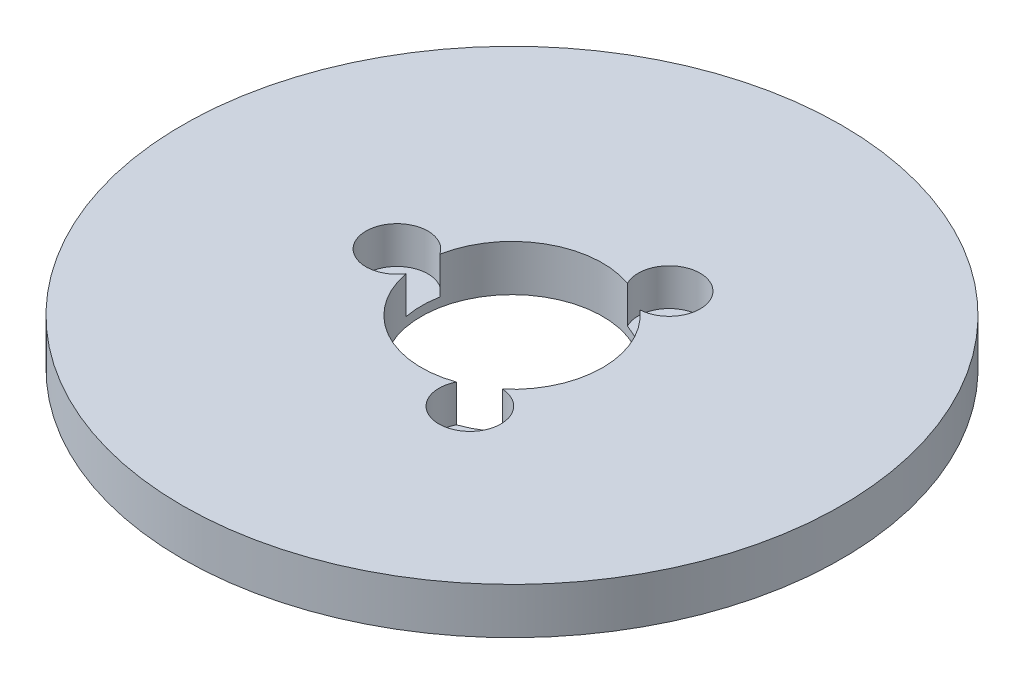
ISO-10303-21;
HEADER;
FILE_DESCRIPTION(('STEP AP214'),'2;1');
FILE_NAME('part.step','',(''),(''),'','','');
FILE_SCHEMA(('AUTOMOTIVE_DESIGN { 1 0 10303 214 1 1 1 1 }'));
ENDSEC;
DATA;
#1=APPLICATION_CONTEXT('core data for automotive mechanical design processes');
#2=APPLICATION_PROTOCOL_DEFINITION('international standard','automotive_design',2000,#1);
#3=PRODUCT_CONTEXT('',#1,'mechanical');
#4=PRODUCT('Part','Part','',(#3));
#5=PRODUCT_RELATED_PRODUCT_CATEGORY('part','',(#4));
#6=PRODUCT_DEFINITION_FORMATION('','',#4);
#7=PRODUCT_DEFINITION_CONTEXT('part definition',#1,'design');
#8=PRODUCT_DEFINITION('design','',#6,#7);
#9=PRODUCT_DEFINITION_SHAPE('','',#8);
#10=(LENGTH_UNIT() NAMED_UNIT(*) SI_UNIT(.MILLI.,.METRE.));
#11=(NAMED_UNIT(*) PLANE_ANGLE_UNIT() SI_UNIT($,.RADIAN.));
#12=(NAMED_UNIT(*) SI_UNIT($,.STERADIAN.) SOLID_ANGLE_UNIT());
#13=UNCERTAINTY_MEASURE_WITH_UNIT(LENGTH_MEASURE(1.E-05),#10,'distance_accuracy_value','');
#14=(GEOMETRIC_REPRESENTATION_CONTEXT(3) GLOBAL_UNCERTAINTY_ASSIGNED_CONTEXT((#13)) GLOBAL_UNIT_ASSIGNED_CONTEXT((#10,
#11,#12)) REPRESENTATION_CONTEXT('',''));
#15=CARTESIAN_POINT('',(0.,0.,0.));
#16=DIRECTION('',(0.,0.,1.));
#17=DIRECTION('',(1.,0.,0.));
#18=AXIS2_PLACEMENT_3D('',#15,#16,#17);
#19=CARTESIAN_POINT('',(0.,14.,0.));
#20=DIRECTION('',(0.,-1.,0.));
#21=DIRECTION('',(0.,0.,-1.));
#22=AXIS2_PLACEMENT_3D('',#19,#20,#21);
#23=CYLINDRICAL_SURFACE('',#22,100.);
#24=CARTESIAN_POINT('',(0.,14.,0.));
#25=DIRECTION('',(0.,1.,0.));
#26=DIRECTION('',(0.,0.,1.));
#27=AXIS2_PLACEMENT_3D('',#24,#25,#26);
#28=CIRCLE('',#27,100.);
#29=CARTESIAN_POINT('',(0.,14.,100.));
#30=VERTEX_POINT('',#29);
#31=EDGE_CURVE('E126',#30,#30,#28,.T.);
#32=ORIENTED_EDGE('',*,*,#31,.F.);
#33=EDGE_LOOP('',(#32));
#34=FACE_BOUND('',#33,.T.);
#35=CARTESIAN_POINT('',(0.,0.,0.));
#36=DIRECTION('',(0.,1.,0.));
#37=DIRECTION('',(0.,0.,1.));
#38=AXIS2_PLACEMENT_3D('',#35,#36,#37);
#39=CIRCLE('',#38,100.);
#40=CARTESIAN_POINT('',(0.,0.,100.));
#41=VERTEX_POINT('',#40);
#42=EDGE_CURVE('E124',#41,#41,#39,.T.);
#43=ORIENTED_EDGE('',*,*,#42,.T.);
#44=EDGE_LOOP('',(#43));
#45=FACE_BOUND('',#44,.T.);
#46=ADVANCED_FACE('F39',(#34,#45),#23,.T.);
#47=CARTESIAN_POINT('',(0.,14.,0.));
#48=DIRECTION('',(0.,1.,0.));
#49=DIRECTION('',(0.,0.,1.));
#50=AXIS2_PLACEMENT_3D('',#47,#48,#49);
#51=PLANE('',#50);
#52=CARTESIAN_POINT('',(17.4566600342866,14.,30.2358221098412));
#53=DIRECTION('',(0.,1.,0.));
#54=DIRECTION('',(0.866025403784436,0.,-0.500000000000004));
#55=AXIS2_PLACEMENT_3D('',#52,#53,#54);
#56=CIRCLE('',#55,9.4045566388682);
#57=CARTESIAN_POINT('',(9.08180578775892,14.,25.9570954390785));
#58=VERTEX_POINT('',#57);
#59=CARTESIAN_POINT('',(17.9386011648199,14.,20.8436222439748));
#60=VERTEX_POINT('',#59);
#61=EDGE_CURVE('E147',#58,#60,#56,.T.);
#62=ORIENTED_EDGE('',*,*,#61,.F.);
#63=CARTESIAN_POINT('',(0.,14.,0.));
#64=DIRECTION('',(0.,1.,0.));
#65=DIRECTION('',(0.,0.,1.));
#66=AXIS2_PLACEMENT_3D('',#63,#64,#65);
#67=CIRCLE('',#66,27.5);
#68=CARTESIAN_POINT('',(-27.0204069525786,14.,5.1134731951036));
#69=VERTEX_POINT('',#68);
#70=EDGE_CURVE('E118',#69,#58,#67,.T.);
#71=ORIENTED_EDGE('',*,*,#70,.F.);
#72=CARTESIAN_POINT('',(-34.913320068573,14.,0.));
#73=DIRECTION('',(0.,1.,0.));
#74=DIRECTION('',(0.,0.,1.));
#75=AXIS2_PLACEMENT_3D('',#72,#73,#74);
#76=CIRCLE('',#75,9.4045566388682);
#77=CARTESIAN_POINT('',(-27.0204069525786,14.,-5.1134731951036));
#78=VERTEX_POINT('',#77);
#79=EDGE_CURVE('E113',#78,#69,#76,.T.);
#80=ORIENTED_EDGE('',*,*,#79,.F.);
#81=CARTESIAN_POINT('',(9.08180578775855,14.,-25.9570954390786));
#82=VERTEX_POINT('',#81);
#83=EDGE_CURVE('E106',#82,#78,#67,.T.);
#84=ORIENTED_EDGE('',*,*,#83,.F.);
#85=CARTESIAN_POINT('',(17.4566600342862,14.,-30.2358221098415));
#86=DIRECTION('',(0.,1.,0.));
#87=DIRECTION('',(-0.866025403784443,0.,-0.499999999999992));
#88=AXIS2_PLACEMENT_3D('',#85,#86,#87);
#89=CIRCLE('',#88,9.4045566388682);
#90=CARTESIAN_POINT('',(17.9386011648196,14.,-20.8436222439751));
#91=VERTEX_POINT('',#90);
#92=EDGE_CURVE('E90',#91,#82,#89,.T.);
#93=ORIENTED_EDGE('',*,*,#92,.F.);
#94=EDGE_CURVE('E116',#60,#91,#67,.T.);
#95=ORIENTED_EDGE('',*,*,#94,.F.);
#96=EDGE_LOOP('',(#62,#71,#80,#84,#93,#95));
#97=FACE_BOUND('',#96,.T.);
#98=ORIENTED_EDGE('',*,*,#31,.T.);
#99=EDGE_LOOP('',(#98));
#100=FACE_BOUND('',#99,.T.);
#101=ADVANCED_FACE('F115',(#97,#100),#51,.T.);
#102=CARTESIAN_POINT('',(0.,0.,0.));
#103=DIRECTION('',(0.,1.,0.));
#104=DIRECTION('',(0.,0.,1.));
#105=AXIS2_PLACEMENT_3D('',#102,#103,#104);
#106=PLANE('',#105);
#107=CARTESIAN_POINT('',(0.,0.,0.));
#108=DIRECTION('',(0.,1.,0.));
#109=DIRECTION('',(0.,0.,1.));
#110=AXIS2_PLACEMENT_3D('',#107,#108,#109);
#111=CIRCLE('',#110,27.5);
#112=CARTESIAN_POINT('',(0.,0.,27.5));
#113=VERTEX_POINT('',#112);
#114=EDGE_CURVE('E120',#113,#113,#111,.T.);
#115=ORIENTED_EDGE('',*,*,#114,.T.);
#116=EDGE_LOOP('',(#115));
#117=FACE_BOUND('',#116,.T.);
#118=ORIENTED_EDGE('',*,*,#42,.F.);
#119=EDGE_LOOP('',(#118));
#120=FACE_BOUND('',#119,.T.);
#121=ADVANCED_FACE('F164',(#117,#120),#106,.F.);
#122=CARTESIAN_POINT('',(0.,14.,0.));
#123=DIRECTION('',(0.,-1.,0.));
#124=DIRECTION('',(0.,0.,-1.));
#125=AXIS2_PLACEMENT_3D('',#122,#123,#124);
#126=CYLINDRICAL_SURFACE('',#125,27.5);
#127=DIRECTION('',(0.,1.,0.));
#128=VECTOR('',#127,1.);
#129=CARTESIAN_POINT('',(9.08180578775892,8.37600155959997,25.9570954390785));
#130=LINE('',#129,#128);
#131=CARTESIAN_POINT('',(9.08180578775892,2.75200311919994,25.9570954390785));
#132=VERTEX_POINT('',#131);
#133=EDGE_CURVE('E11',#132,#58,#130,.T.);
#134=ORIENTED_EDGE('',*,*,#133,.F.);
#135=CARTESIAN_POINT('',(0.,2.75200311919994,0.));
#136=DIRECTION('',(0.,1.,0.));
#137=DIRECTION('',(0.,0.,1.));
#138=AXIS2_PLACEMENT_3D('',#135,#136,#137);
#139=CIRCLE('',#138,27.5);
#140=CARTESIAN_POINT('',(17.9386011648199,2.75200311919994,20.8436222439748));
#141=VERTEX_POINT('',#140);
#142=EDGE_CURVE('E144',#132,#141,#139,.T.);
#143=ORIENTED_EDGE('',*,*,#142,.T.);
#144=DIRECTION('',(0.,1.,0.));
#145=VECTOR('',#144,1.);
#146=CARTESIAN_POINT('',(17.9386011648199,8.37600155959997,20.8436222439748));
#147=LINE('',#146,#145);
#148=EDGE_CURVE('E46',#60,#141,#147,.F.);
#149=ORIENTED_EDGE('',*,*,#148,.F.);
#150=ORIENTED_EDGE('',*,*,#94,.T.);
#151=DIRECTION('',(0.,1.,0.));
#152=VECTOR('',#151,1.);
#153=CARTESIAN_POINT('',(17.9386011648196,8.37600155959997,-20.8436222439751));
#154=LINE('',#153,#152);
#155=CARTESIAN_POINT('',(17.9386011648196,2.75200311919994,-20.8436222439751));
#156=VERTEX_POINT('',#155);
#157=EDGE_CURVE('E92',#156,#91,#154,.T.);
#158=ORIENTED_EDGE('',*,*,#157,.F.);
#159=CARTESIAN_POINT('',(0.,2.75200311919994,0.));
#160=DIRECTION('',(0.,1.,0.));
#161=DIRECTION('',(0.,0.,1.));
#162=AXIS2_PLACEMENT_3D('',#159,#160,#161);
#163=CIRCLE('',#162,27.5);
#164=CARTESIAN_POINT('',(9.08180578775855,2.75200311919994,-25.9570954390786));
#165=VERTEX_POINT('',#164);
#166=EDGE_CURVE('E107',#156,#165,#163,.T.);
#167=ORIENTED_EDGE('',*,*,#166,.T.);
#168=DIRECTION('',(0.,1.,0.));
#169=VECTOR('',#168,1.);
#170=CARTESIAN_POINT('',(9.08180578775856,8.37600155959997,-25.9570954390786));
#171=LINE('',#170,#169);
#172=EDGE_CURVE('E95',#82,#165,#171,.F.);
#173=ORIENTED_EDGE('',*,*,#172,.F.);
#174=ORIENTED_EDGE('',*,*,#83,.T.);
#175=DIRECTION('',(0.,1.,0.));
#176=VECTOR('',#175,1.);
#177=CARTESIAN_POINT('',(-27.0204069525786,8.37600155959997,-5.1134731951036));
#178=LINE('',#177,#176);
#179=CARTESIAN_POINT('',(-27.0204069525786,2.75200311919994,-5.1134731951036));
#180=VERTEX_POINT('',#179);
#181=EDGE_CURVE('E143',#180,#78,#178,.T.);
#182=ORIENTED_EDGE('',*,*,#181,.F.);
#183=CARTESIAN_POINT('',(0.,2.75200311919994,0.));
#184=DIRECTION('',(0.,1.,0.));
#185=DIRECTION('',(0.,0.,1.));
#186=AXIS2_PLACEMENT_3D('',#183,#184,#185);
#187=CIRCLE('',#186,27.5);
#188=CARTESIAN_POINT('',(-27.0204069525786,2.75200311919994,5.1134731951036));
#189=VERTEX_POINT('',#188);
#190=EDGE_CURVE('E132',#180,#189,#187,.T.);
#191=ORIENTED_EDGE('',*,*,#190,.T.);
#192=DIRECTION('',(0.,1.,0.));
#193=VECTOR('',#192,1.);
#194=CARTESIAN_POINT('',(-27.0204069525786,8.37600155959997,5.1134731951036));
#195=LINE('',#194,#193);
#196=EDGE_CURVE('E137',#69,#189,#195,.F.);
#197=ORIENTED_EDGE('',*,*,#196,.F.);
#198=ORIENTED_EDGE('',*,*,#70,.T.);
#199=EDGE_LOOP('',(#134,#143,#149,#150,#158,#167,#173,#174,#182,#191,#197,#198));
#200=FACE_BOUND('',#199,.T.);
#201=ORIENTED_EDGE('',*,*,#114,.F.);
#202=EDGE_LOOP('',(#201));
#203=FACE_BOUND('',#202,.T.);
#204=ADVANCED_FACE('F103',(#200,#203),#126,.F.);
#205=CARTESIAN_POINT('',(-34.913320068573,2.75200311919994,0.));
#206=DIRECTION('',(0.,1.,0.));
#207=DIRECTION('',(0.,0.,1.));
#208=AXIS2_PLACEMENT_3D('',#205,#206,#207);
#209=CYLINDRICAL_SURFACE('',#208,9.4045566388682);
#210=ORIENTED_EDGE('',*,*,#181,.T.);
#211=ORIENTED_EDGE('',*,*,#79,.T.);
#212=ORIENTED_EDGE('',*,*,#196,.T.);
#213=CARTESIAN_POINT('',(-34.913320068573,2.75200311919994,0.));
#214=DIRECTION('',(0.,1.,0.));
#215=DIRECTION('',(0.,0.,1.));
#216=AXIS2_PLACEMENT_3D('',#213,#214,#215);
#217=CIRCLE('',#216,9.4045566388682);
#218=EDGE_CURVE('E121',#180,#189,#217,.T.);
#219=ORIENTED_EDGE('',*,*,#218,.F.);
#220=EDGE_LOOP('',(#210,#211,#212,#219));
#221=FACE_BOUND('',#220,.T.);
#222=ADVANCED_FACE('F174',(#221),#209,.F.);
#223=CARTESIAN_POINT('',(-34.913320068573,2.75200311919994,0.));
#224=DIRECTION('',(0.,1.,0.));
#225=DIRECTION('',(0.,0.,1.));
#226=AXIS2_PLACEMENT_3D('',#223,#224,#225);
#227=PLANE('',#226);
#228=ORIENTED_EDGE('',*,*,#218,.T.);
#229=ORIENTED_EDGE('',*,*,#190,.F.);
#230=EDGE_LOOP('',(#228,#229));
#231=FACE_BOUND('',#230,.T.);
#232=ADVANCED_FACE('F177',(#231),#227,.T.);
#233=CARTESIAN_POINT('',(17.4566600342862,2.75200311919994,-30.2358221098415));
#234=DIRECTION('',(0.,1.,0.));
#235=DIRECTION('',(0.,0.,1.));
#236=AXIS2_PLACEMENT_3D('',#233,#234,#235);
#237=CYLINDRICAL_SURFACE('',#236,9.4045566388682);
#238=ORIENTED_EDGE('',*,*,#157,.T.);
#239=ORIENTED_EDGE('',*,*,#92,.T.);
#240=ORIENTED_EDGE('',*,*,#172,.T.);
#241=CARTESIAN_POINT('',(17.4566600342862,2.75200311919994,-30.2358221098415));
#242=DIRECTION('',(0.,1.,0.));
#243=DIRECTION('',(-0.866025403784443,0.,-0.499999999999992));
#244=AXIS2_PLACEMENT_3D('',#241,#242,#243);
#245=CIRCLE('',#244,9.4045566388682);
#246=EDGE_CURVE('E56',#156,#165,#245,.T.);
#247=ORIENTED_EDGE('',*,*,#246,.F.);
#248=EDGE_LOOP('',(#238,#239,#240,#247));
#249=FACE_BOUND('',#248,.T.);
#250=ADVANCED_FACE('F93',(#249),#237,.F.);
#251=CARTESIAN_POINT('',(17.4566600342862,2.75200311919994,-30.2358221098415));
#252=DIRECTION('',(0.,1.,0.));
#253=DIRECTION('',(-0.866025403784443,0.,-0.499999999999992));
#254=AXIS2_PLACEMENT_3D('',#251,#252,#253);
#255=PLANE('',#254);
#256=ORIENTED_EDGE('',*,*,#246,.T.);
#257=ORIENTED_EDGE('',*,*,#166,.F.);
#258=EDGE_LOOP('',(#256,#257));
#259=FACE_BOUND('',#258,.T.);
#260=ADVANCED_FACE('F160',(#259),#255,.T.);
#261=CARTESIAN_POINT('',(17.4566600342866,2.75200311919994,30.2358221098412));
#262=DIRECTION('',(0.,1.,0.));
#263=DIRECTION('',(0.,0.,1.));
#264=AXIS2_PLACEMENT_3D('',#261,#262,#263);
#265=CYLINDRICAL_SURFACE('',#264,9.4045566388682);
#266=ORIENTED_EDGE('',*,*,#133,.T.);
#267=ORIENTED_EDGE('',*,*,#61,.T.);
#268=ORIENTED_EDGE('',*,*,#148,.T.);
#269=CARTESIAN_POINT('',(17.4566600342866,2.75200311919994,30.2358221098412));
#270=DIRECTION('',(0.,1.,0.));
#271=DIRECTION('',(0.866025403784436,0.,-0.500000000000004));
#272=AXIS2_PLACEMENT_3D('',#269,#270,#271);
#273=CIRCLE('',#272,9.4045566388682);
#274=EDGE_CURVE('E55',#132,#141,#273,.T.);
#275=ORIENTED_EDGE('',*,*,#274,.F.);
#276=EDGE_LOOP('',(#266,#267,#268,#275));
#277=FACE_BOUND('',#276,.T.);
#278=ADVANCED_FACE('F149',(#277),#265,.F.);
#279=CARTESIAN_POINT('',(17.4566600342866,2.75200311919994,30.2358221098412));
#280=DIRECTION('',(0.,1.,0.));
#281=DIRECTION('',(0.866025403784436,0.,-0.500000000000004));
#282=AXIS2_PLACEMENT_3D('',#279,#280,#281);
#283=PLANE('',#282);
#284=ORIENTED_EDGE('',*,*,#274,.T.);
#285=ORIENTED_EDGE('',*,*,#142,.F.);
#286=EDGE_LOOP('',(#284,#285));
#287=FACE_BOUND('',#286,.T.);
#288=ADVANCED_FACE('F151',(#287),#283,.T.);
#289=CLOSED_SHELL('',(#46,#101,#121,#204,#222,#232,#250,#260,#278,#288));
#290=MANIFOLD_SOLID_BREP('B2',#289);
#291=ADVANCED_BREP_SHAPE_REPRESENTATION('',(#18,#290),#14);
#292=SHAPE_DEFINITION_REPRESENTATION(#9,#291);
ENDSEC;
END-ISO-10303-21;
